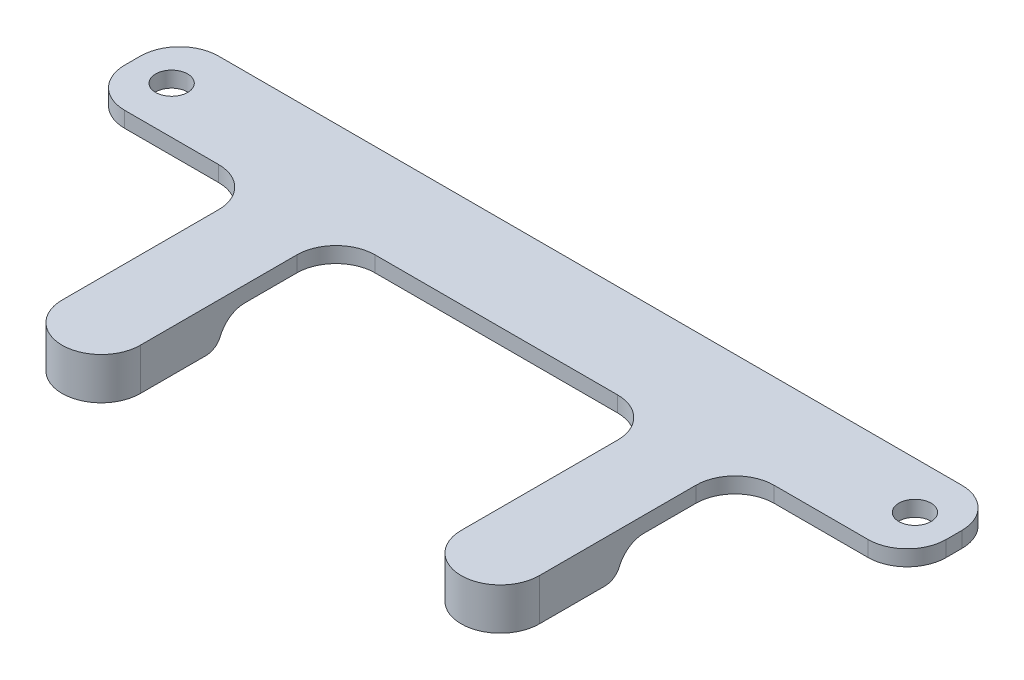
ISO-10303-21;
HEADER;
FILE_DESCRIPTION(('STEP AP214'),'2;1');
FILE_NAME('part.step','',(''),(''),'','','');
FILE_SCHEMA(('AUTOMOTIVE_DESIGN { 1 0 10303 214 1 1 1 1 }'));
ENDSEC;
DATA;
#1=APPLICATION_CONTEXT('core data for automotive mechanical design processes');
#2=APPLICATION_PROTOCOL_DEFINITION('international standard','automotive_design',2000,#1);
#3=PRODUCT_CONTEXT('',#1,'mechanical');
#4=PRODUCT('Part','Part','',(#3));
#5=PRODUCT_RELATED_PRODUCT_CATEGORY('part','',(#4));
#6=PRODUCT_DEFINITION_FORMATION('','',#4);
#7=PRODUCT_DEFINITION_CONTEXT('part definition',#1,'design');
#8=PRODUCT_DEFINITION('design','',#6,#7);
#9=PRODUCT_DEFINITION_SHAPE('','',#8);
#10=(LENGTH_UNIT() NAMED_UNIT(*) SI_UNIT(.MILLI.,.METRE.));
#11=(NAMED_UNIT(*) PLANE_ANGLE_UNIT() SI_UNIT($,.RADIAN.));
#12=(NAMED_UNIT(*) SI_UNIT($,.STERADIAN.) SOLID_ANGLE_UNIT());
#13=UNCERTAINTY_MEASURE_WITH_UNIT(LENGTH_MEASURE(1.E-05),#10,'distance_accuracy_value','');
#14=(GEOMETRIC_REPRESENTATION_CONTEXT(3) GLOBAL_UNCERTAINTY_ASSIGNED_CONTEXT((#13)) GLOBAL_UNIT_ASSIGNED_CONTEXT((#10,
#11,#12)) REPRESENTATION_CONTEXT('',''));
#15=CARTESIAN_POINT('',(0.,0.,0.));
#16=DIRECTION('',(0.,0.,1.));
#17=DIRECTION('',(1.,0.,0.));
#18=AXIS2_PLACEMENT_3D('',#15,#16,#17);
#19=CARTESIAN_POINT('',(0.,0.,0.));
#20=DIRECTION('',(0.,1.,0.));
#21=DIRECTION('',(0.,0.,1.));
#22=AXIS2_PLACEMENT_3D('',#19,#20,#21);
#23=PLANE('',#22);
#24=CARTESIAN_POINT('',(47.5,0.,0.));
#25=DIRECTION('',(0.,1.,0.));
#26=DIRECTION('',(0.,0.,-1.));
#27=AXIS2_PLACEMENT_3D('',#24,#25,#26);
#28=CIRCLE('',#27,2.05);
#29=CARTESIAN_POINT('',(47.5,0.,-2.05));
#30=VERTEX_POINT('',#29);
#31=EDGE_CURVE('E259',#30,#30,#28,.T.);
#32=ORIENTED_EDGE('',*,*,#31,.T.);
#33=EDGE_LOOP('',(#32));
#34=FACE_BOUND('',#33,.T.);
#35=CARTESIAN_POINT('',(-47.5,0.,0.));
#36=DIRECTION('',(0.,1.,0.));
#37=DIRECTION('',(0.,0.,1.));
#38=AXIS2_PLACEMENT_3D('',#35,#36,#37);
#39=CIRCLE('',#38,2.05);
#40=CARTESIAN_POINT('',(-47.5,0.,2.05));
#41=VERTEX_POINT('',#40);
#42=EDGE_CURVE('E260',#41,#41,#39,.T.);
#43=ORIENTED_EDGE('',*,*,#42,.T.);
#44=EDGE_LOOP('',(#43));
#45=FACE_BOUND('',#44,.T.);
#46=DIRECTION('',(0.,0.,-1.));
#47=VECTOR('',#46,1.);
#48=CARTESIAN_POINT('',(30.5,0.,6.));
#49=LINE('',#48,#47);
#50=CARTESIAN_POINT('',(30.5,0.,17.6400148809853));
#51=VERTEX_POINT('',#50);
#52=CARTESIAN_POINT('',(30.5,0.,11.));
#53=VERTEX_POINT('',#52);
#54=EDGE_CURVE('E335',#51,#53,#49,.T.);
#55=ORIENTED_EDGE('',*,*,#54,.F.);
#56=DIRECTION('',(-1.,0.,0.));
#57=VECTOR('',#56,1.);
#58=CARTESIAN_POINT('',(0.,0.,17.6400148809853));
#59=LINE('',#58,#57);
#60=CARTESIAN_POINT('',(20.5,0.,17.6400148809853));
#61=VERTEX_POINT('',#60);
#62=EDGE_CURVE('E492',#51,#61,#59,.T.);
#63=ORIENTED_EDGE('',*,*,#62,.T.);
#64=DIRECTION('',(0.,0.,1.));
#65=VECTOR('',#64,1.);
#66=CARTESIAN_POINT('',(20.5,0.,6.));
#67=LINE('',#66,#65);
#68=CARTESIAN_POINT('',(20.5,0.,11.));
#69=VERTEX_POINT('',#68);
#70=EDGE_CURVE('E331',#69,#61,#67,.T.);
#71=ORIENTED_EDGE('',*,*,#70,.F.);
#72=CARTESIAN_POINT('',(15.5,0.,11.));
#73=DIRECTION('',(0.,1.,0.));
#74=DIRECTION('',(0.,0.,1.));
#75=AXIS2_PLACEMENT_3D('',#72,#73,#74);
#76=CIRCLE('',#75,5.);
#77=CARTESIAN_POINT('',(15.5,0.,6.));
#78=VERTEX_POINT('',#77);
#79=EDGE_CURVE('E442',#69,#78,#76,.T.);
#80=ORIENTED_EDGE('',*,*,#79,.T.);
#81=DIRECTION('',(1.,0.,0.));
#82=VECTOR('',#81,1.);
#83=CARTESIAN_POINT('',(-20.5,0.,6.));
#84=LINE('',#83,#82);
#85=CARTESIAN_POINT('',(-15.5,0.,6.));
#86=VERTEX_POINT('',#85);
#87=EDGE_CURVE('E327',#86,#78,#84,.T.);
#88=ORIENTED_EDGE('',*,*,#87,.F.);
#89=CARTESIAN_POINT('',(-15.5,0.,11.));
#90=DIRECTION('',(0.,1.,0.));
#91=DIRECTION('',(0.,0.,1.));
#92=AXIS2_PLACEMENT_3D('',#89,#90,#91);
#93=CIRCLE('',#92,5.);
#94=CARTESIAN_POINT('',(-20.5,0.,11.));
#95=VERTEX_POINT('',#94);
#96=EDGE_CURVE('E455',#86,#95,#93,.T.);
#97=ORIENTED_EDGE('',*,*,#96,.T.);
#98=DIRECTION('',(0.,0.,-1.));
#99=VECTOR('',#98,1.);
#100=CARTESIAN_POINT('',(-20.5,0.,6.));
#101=LINE('',#100,#99);
#102=CARTESIAN_POINT('',(-20.5,0.,17.6400148809853));
#103=VERTEX_POINT('',#102);
#104=EDGE_CURVE('E324',#103,#95,#101,.T.);
#105=ORIENTED_EDGE('',*,*,#104,.F.);
#106=DIRECTION('',(1.,0.,0.));
#107=VECTOR('',#106,1.);
#108=CARTESIAN_POINT('',(0.,0.,17.6400148809853));
#109=LINE('',#108,#107);
#110=CARTESIAN_POINT('',(-30.5,0.,17.6400148809853));
#111=VERTEX_POINT('',#110);
#112=EDGE_CURVE('E468',#103,#111,#109,.F.);
#113=ORIENTED_EDGE('',*,*,#112,.T.);
#114=DIRECTION('',(0.,0.,1.));
#115=VECTOR('',#114,1.);
#116=CARTESIAN_POINT('',(-30.5,0.,6.));
#117=LINE('',#116,#115);
#118=CARTESIAN_POINT('',(-30.5,0.,11.));
#119=VERTEX_POINT('',#118);
#120=EDGE_CURVE('E320',#119,#111,#117,.T.);
#121=ORIENTED_EDGE('',*,*,#120,.F.);
#122=CARTESIAN_POINT('',(-35.5,0.,11.));
#123=DIRECTION('',(0.,1.,0.));
#124=DIRECTION('',(0.,0.,1.));
#125=AXIS2_PLACEMENT_3D('',#122,#123,#124);
#126=CIRCLE('',#125,5.);
#127=CARTESIAN_POINT('',(-35.5,0.,6.));
#128=VERTEX_POINT('',#127);
#129=EDGE_CURVE('E462',#119,#128,#126,.T.);
#130=ORIENTED_EDGE('',*,*,#129,.T.);
#131=DIRECTION('',(1.,0.,0.));
#132=VECTOR('',#131,1.);
#133=CARTESIAN_POINT('',(-52.5,0.,6.));
#134=LINE('',#133,#132);
#135=CARTESIAN_POINT('',(-47.5,0.,6.));
#136=VERTEX_POINT('',#135);
#137=EDGE_CURVE('E316',#136,#128,#134,.T.);
#138=ORIENTED_EDGE('',*,*,#137,.F.);
#139=CARTESIAN_POINT('',(-47.5,0.,1.));
#140=DIRECTION('',(0.,1.,0.));
#141=DIRECTION('',(0.,0.,1.));
#142=AXIS2_PLACEMENT_3D('',#139,#140,#141);
#143=CIRCLE('',#142,5.);
#144=CARTESIAN_POINT('',(-52.5,0.,1.));
#145=VERTEX_POINT('',#144);
#146=EDGE_CURVE('E355',#136,#145,#143,.F.);
#147=ORIENTED_EDGE('',*,*,#146,.T.);
#148=DIRECTION('',(0.,0.,1.));
#149=VECTOR('',#148,1.);
#150=CARTESIAN_POINT('',(-52.5,0.,-6.));
#151=LINE('',#150,#149);
#152=CARTESIAN_POINT('',(-52.5,0.,-1.));
#153=VERTEX_POINT('',#152);
#154=EDGE_CURVE('E264',#153,#145,#151,.T.);
#155=ORIENTED_EDGE('',*,*,#154,.F.);
#156=CARTESIAN_POINT('',(-47.5,0.,-1.));
#157=DIRECTION('',(0.,1.,0.));
#158=DIRECTION('',(0.,0.,1.));
#159=AXIS2_PLACEMENT_3D('',#156,#157,#158);
#160=CIRCLE('',#159,5.);
#161=CARTESIAN_POINT('',(-47.5,0.,-6.));
#162=VERTEX_POINT('',#161);
#163=EDGE_CURVE('E358',#153,#162,#160,.F.);
#164=ORIENTED_EDGE('',*,*,#163,.T.);
#165=DIRECTION('',(-1.,0.,0.));
#166=VECTOR('',#165,1.);
#167=CARTESIAN_POINT('',(-52.5,0.,-6.));
#168=LINE('',#167,#166);
#169=CARTESIAN_POINT('',(47.5,0.,-6.));
#170=VERTEX_POINT('',#169);
#171=EDGE_CURVE('E281',#170,#162,#168,.T.);
#172=ORIENTED_EDGE('',*,*,#171,.F.);
#173=CARTESIAN_POINT('',(47.5,0.,-1.));
#174=DIRECTION('',(0.,1.,0.));
#175=DIRECTION('',(0.,0.,1.));
#176=AXIS2_PLACEMENT_3D('',#173,#174,#175);
#177=CIRCLE('',#176,5.);
#178=CARTESIAN_POINT('',(52.5,0.,-1.));
#179=VERTEX_POINT('',#178);
#180=EDGE_CURVE('E364',#170,#179,#177,.F.);
#181=ORIENTED_EDGE('',*,*,#180,.T.);
#182=DIRECTION('',(0.,0.,-1.));
#183=VECTOR('',#182,1.);
#184=CARTESIAN_POINT('',(52.5,0.,-6.));
#185=LINE('',#184,#183);
#186=CARTESIAN_POINT('',(52.5,0.,1.));
#187=VERTEX_POINT('',#186);
#188=EDGE_CURVE('E342',#187,#179,#185,.T.);
#189=ORIENTED_EDGE('',*,*,#188,.F.);
#190=CARTESIAN_POINT('',(47.5,0.,1.));
#191=DIRECTION('',(0.,1.,0.));
#192=DIRECTION('',(0.,0.,1.));
#193=AXIS2_PLACEMENT_3D('',#190,#191,#192);
#194=CIRCLE('',#193,5.);
#195=CARTESIAN_POINT('',(47.5,0.,6.));
#196=VERTEX_POINT('',#195);
#197=EDGE_CURVE('E361',#187,#196,#194,.F.);
#198=ORIENTED_EDGE('',*,*,#197,.T.);
#199=DIRECTION('',(1.,0.,0.));
#200=VECTOR('',#199,1.);
#201=CARTESIAN_POINT('',(30.5,0.,6.));
#202=LINE('',#201,#200);
#203=CARTESIAN_POINT('',(35.5,0.,6.));
#204=VERTEX_POINT('',#203);
#205=EDGE_CURVE('E338',#204,#196,#202,.T.);
#206=ORIENTED_EDGE('',*,*,#205,.F.);
#207=CARTESIAN_POINT('',(35.5,0.,11.));
#208=DIRECTION('',(0.,1.,0.));
#209=DIRECTION('',(0.,0.,1.));
#210=AXIS2_PLACEMENT_3D('',#207,#208,#209);
#211=CIRCLE('',#210,5.);
#212=EDGE_CURVE('E448',#204,#53,#211,.T.);
#213=ORIENTED_EDGE('',*,*,#212,.T.);
#214=EDGE_LOOP('',(#55,#63,#71,#80,#88,#97,#105,#113,#121,#130,#138,#147,#155,#164,#172,#181,
#189,#198,#206,#213));
#215=FACE_BOUND('',#214,.T.);
#216=ADVANCED_FACE('F43',(#34,#45,#215),#23,.F.);
#217=CARTESIAN_POINT('',(-52.5,2.,-6.));
#218=DIRECTION('',(1.,0.,0.));
#219=DIRECTION('',(0.,0.,-1.));
#220=AXIS2_PLACEMENT_3D('',#217,#218,#219);
#221=PLANE('',#220);
#222=DIRECTION('',(0.,0.,1.));
#223=VECTOR('',#222,1.);
#224=CARTESIAN_POINT('',(-52.5,2.,-6.));
#225=LINE('',#224,#223);
#226=CARTESIAN_POINT('',(-52.5,2.,-1.));
#227=VERTEX_POINT('',#226);
#228=CARTESIAN_POINT('',(-52.5,2.,1.));
#229=VERTEX_POINT('',#228);
#230=EDGE_CURVE('E276',#227,#229,#225,.T.);
#231=ORIENTED_EDGE('',*,*,#230,.F.);
#232=DIRECTION('',(0.,-1.,0.));
#233=VECTOR('',#232,1.);
#234=CARTESIAN_POINT('',(-52.5,2.,-1.));
#235=LINE('',#234,#233);
#236=EDGE_CURVE('E438',#227,#153,#235,.T.);
#237=ORIENTED_EDGE('',*,*,#236,.T.);
#238=ORIENTED_EDGE('',*,*,#154,.T.);
#239=DIRECTION('',(0.,-1.,0.));
#240=VECTOR('',#239,1.);
#241=CARTESIAN_POINT('',(-52.5,2.,1.));
#242=LINE('',#241,#240);
#243=EDGE_CURVE('E435',#145,#229,#242,.F.);
#244=ORIENTED_EDGE('',*,*,#243,.T.);
#245=EDGE_LOOP('',(#231,#237,#238,#244));
#246=FACE_BOUND('',#245,.T.);
#247=ADVANCED_FACE('F517',(#246),#221,.F.);
#248=CARTESIAN_POINT('',(-52.5,2.,6.));
#249=DIRECTION('',(0.,0.,-1.));
#250=DIRECTION('',(-1.,0.,0.));
#251=AXIS2_PLACEMENT_3D('',#248,#249,#250);
#252=PLANE('',#251);
#253=ORIENTED_EDGE('',*,*,#137,.T.);
#254=DIRECTION('',(0.,-1.,0.));
#255=VECTOR('',#254,1.);
#256=CARTESIAN_POINT('',(-35.5,2.,6.));
#257=LINE('',#256,#255);
#258=CARTESIAN_POINT('',(-35.5,2.,6.));
#259=VERTEX_POINT('',#258);
#260=EDGE_CURVE('E432',#128,#259,#257,.F.);
#261=ORIENTED_EDGE('',*,*,#260,.T.);
#262=DIRECTION('',(1.,0.,0.));
#263=VECTOR('',#262,1.);
#264=CARTESIAN_POINT('',(-52.5,2.,6.));
#265=LINE('',#264,#263);
#266=CARTESIAN_POINT('',(-47.5,2.,6.));
#267=VERTEX_POINT('',#266);
#268=EDGE_CURVE('E280',#267,#259,#265,.T.);
#269=ORIENTED_EDGE('',*,*,#268,.F.);
#270=DIRECTION('',(0.,-1.,0.));
#271=VECTOR('',#270,1.);
#272=CARTESIAN_POINT('',(-47.5,2.,6.));
#273=LINE('',#272,#271);
#274=EDGE_CURVE('E428',#267,#136,#273,.T.);
#275=ORIENTED_EDGE('',*,*,#274,.T.);
#276=EDGE_LOOP('',(#253,#261,#269,#275));
#277=FACE_BOUND('',#276,.T.);
#278=ADVANCED_FACE('F523',(#277),#252,.F.);
#279=CARTESIAN_POINT('',(-30.5,2.,6.));
#280=DIRECTION('',(1.,0.,0.));
#281=DIRECTION('',(0.,0.,-1.));
#282=AXIS2_PLACEMENT_3D('',#279,#280,#281);
#283=PLANE('',#282);
#284=CARTESIAN_POINT('',(-30.5,-3.36,17.6400148809853));
#285=DIRECTION('',(1.,0.,0.));
#286=DIRECTION('',(0.,0.,-1.));
#287=AXIS2_PLACEMENT_3D('',#284,#285,#286);
#288=CIRCLE('',#287,3.36);
#289=CARTESIAN_POINT('',(-30.5,-2.1,20.7548182455655));
#290=VERTEX_POINT('',#289);
#291=EDGE_CURVE('E472',#111,#290,#288,.T.);
#292=ORIENTED_EDGE('',*,*,#291,.T.);
#293=CARTESIAN_POINT('',(-30.5,-1.35,22.6088678673394));
#294=DIRECTION('',(1.,0.,0.));
#295=DIRECTION('',(0.,0.,-1.));
#296=AXIS2_PLACEMENT_3D('',#293,#294,#295);
#297=CIRCLE('',#296,2.);
#298=CARTESIAN_POINT('',(-30.5,-3.35,22.6088678673394));
#299=VERTEX_POINT('',#298);
#300=EDGE_CURVE('E483',#290,#299,#297,.F.);
#301=ORIENTED_EDGE('',*,*,#300,.T.);
#302=DIRECTION('',(0.,0.,1.));
#303=VECTOR('',#302,1.);
#304=CARTESIAN_POINT('',(-30.5,-3.35,21.));
#305=LINE('',#304,#303);
#306=CARTESIAN_POINT('',(-30.5,-3.35,31.));
#307=VERTEX_POINT('',#306);
#308=EDGE_CURVE('E256',#299,#307,#305,.T.);
#309=ORIENTED_EDGE('',*,*,#308,.T.);
#310=DIRECTION('',(0.,-1.,0.));
#311=VECTOR('',#310,1.);
#312=CARTESIAN_POINT('',(-30.5,2.,31.));
#313=LINE('',#312,#311);
#314=CARTESIAN_POINT('',(-30.5,2.,31.));
#315=VERTEX_POINT('',#314);
#316=EDGE_CURVE('E417',#307,#315,#313,.F.);
#317=ORIENTED_EDGE('',*,*,#316,.T.);
#318=DIRECTION('',(0.,0.,1.));
#319=VECTOR('',#318,1.);
#320=CARTESIAN_POINT('',(-30.5,2.,6.));
#321=LINE('',#320,#319);
#322=CARTESIAN_POINT('',(-30.5,2.,11.));
#323=VERTEX_POINT('',#322);
#324=EDGE_CURVE('E285',#323,#315,#321,.T.);
#325=ORIENTED_EDGE('',*,*,#324,.F.);
#326=DIRECTION('',(0.,-1.,0.));
#327=VECTOR('',#326,1.);
#328=CARTESIAN_POINT('',(-30.5,0.,11.));
#329=LINE('',#328,#327);
#330=EDGE_CURVE('E413',#323,#119,#329,.T.);
#331=ORIENTED_EDGE('',*,*,#330,.T.);
#332=ORIENTED_EDGE('',*,*,#120,.T.);
#333=EDGE_LOOP('',(#292,#301,#309,#317,#325,#331,#332));
#334=FACE_BOUND('',#333,.T.);
#335=ADVANCED_FACE('F554',(#334),#283,.F.);
#336=CARTESIAN_POINT('',(-20.5,2.,6.));
#337=DIRECTION('',(-1.,0.,0.));
#338=DIRECTION('',(0.,0.,1.));
#339=AXIS2_PLACEMENT_3D('',#336,#337,#338);
#340=PLANE('',#339);
#341=DIRECTION('',(0.,0.,-1.));
#342=VECTOR('',#341,1.);
#343=CARTESIAN_POINT('',(-20.5,-3.35,31.));
#344=LINE('',#343,#342);
#345=CARTESIAN_POINT('',(-20.5,-3.35,31.));
#346=VERTEX_POINT('',#345);
#347=CARTESIAN_POINT('',(-20.5,-3.35,22.6088678673394));
#348=VERTEX_POINT('',#347);
#349=EDGE_CURVE('E252',#346,#348,#344,.T.);
#350=ORIENTED_EDGE('',*,*,#349,.T.);
#351=CARTESIAN_POINT('',(-20.5,-1.35,22.6088678673394));
#352=DIRECTION('',(-1.,0.,0.));
#353=DIRECTION('',(0.,0.,1.));
#354=AXIS2_PLACEMENT_3D('',#351,#352,#353);
#355=CIRCLE('',#354,2.);
#356=CARTESIAN_POINT('',(-20.5,-2.1,20.7548182455655));
#357=VERTEX_POINT('',#356);
#358=EDGE_CURVE('E489',#348,#357,#355,.F.);
#359=ORIENTED_EDGE('',*,*,#358,.T.);
#360=CARTESIAN_POINT('',(-20.5,-3.36,17.6400148809853));
#361=DIRECTION('',(-1.,0.,0.));
#362=DIRECTION('',(0.,0.,1.));
#363=AXIS2_PLACEMENT_3D('',#360,#361,#362);
#364=CIRCLE('',#363,3.36);
#365=EDGE_CURVE('E476',#357,#103,#364,.T.);
#366=ORIENTED_EDGE('',*,*,#365,.T.);
#367=ORIENTED_EDGE('',*,*,#104,.T.);
#368=DIRECTION('',(0.,-1.,0.));
#369=VECTOR('',#368,1.);
#370=CARTESIAN_POINT('',(-20.5,2.,11.));
#371=LINE('',#370,#369);
#372=CARTESIAN_POINT('',(-20.5,2.,11.));
#373=VERTEX_POINT('',#372);
#374=EDGE_CURVE('E421',#95,#373,#371,.F.);
#375=ORIENTED_EDGE('',*,*,#374,.T.);
#376=DIRECTION('',(0.,0.,-1.));
#377=VECTOR('',#376,1.);
#378=CARTESIAN_POINT('',(-20.5,2.,6.));
#379=LINE('',#378,#377);
#380=CARTESIAN_POINT('',(-20.5,2.,31.));
#381=VERTEX_POINT('',#380);
#382=EDGE_CURVE('E288',#381,#373,#379,.T.);
#383=ORIENTED_EDGE('',*,*,#382,.F.);
#384=DIRECTION('',(0.,-1.,0.));
#385=VECTOR('',#384,1.);
#386=CARTESIAN_POINT('',(-20.5,2.,31.));
#387=LINE('',#386,#385);
#388=EDGE_CURVE('E425',#381,#346,#387,.T.);
#389=ORIENTED_EDGE('',*,*,#388,.T.);
#390=EDGE_LOOP('',(#350,#359,#366,#367,#375,#383,#389));
#391=FACE_BOUND('',#390,.T.);
#392=ADVANCED_FACE('F550',(#391),#340,.F.);
#393=CARTESIAN_POINT('',(-20.5,2.,6.));
#394=DIRECTION('',(0.,0.,-1.));
#395=DIRECTION('',(-1.,0.,0.));
#396=AXIS2_PLACEMENT_3D('',#393,#394,#395);
#397=PLANE('',#396);
#398=ORIENTED_EDGE('',*,*,#87,.T.);
#399=DIRECTION('',(0.,-1.,0.));
#400=VECTOR('',#399,1.);
#401=CARTESIAN_POINT('',(15.5,2.,6.));
#402=LINE('',#401,#400);
#403=CARTESIAN_POINT('',(15.5,2.,6.));
#404=VERTEX_POINT('',#403);
#405=EDGE_CURVE('E237',#78,#404,#402,.F.);
#406=ORIENTED_EDGE('',*,*,#405,.T.);
#407=DIRECTION('',(1.,0.,0.));
#408=VECTOR('',#407,1.);
#409=CARTESIAN_POINT('',(-20.5,2.,6.));
#410=LINE('',#409,#408);
#411=CARTESIAN_POINT('',(-15.5,2.,6.));
#412=VERTEX_POINT('',#411);
#413=EDGE_CURVE('E291',#412,#404,#410,.T.);
#414=ORIENTED_EDGE('',*,*,#413,.F.);
#415=DIRECTION('',(0.,-1.,0.));
#416=VECTOR('',#415,1.);
#417=CARTESIAN_POINT('',(-15.5,0.,6.));
#418=LINE('',#417,#416);
#419=EDGE_CURVE('E405',#412,#86,#418,.T.);
#420=ORIENTED_EDGE('',*,*,#419,.T.);
#421=EDGE_LOOP('',(#398,#406,#414,#420));
#422=FACE_BOUND('',#421,.T.);
#423=ADVANCED_FACE('F547',(#422),#397,.F.);
#424=CARTESIAN_POINT('',(20.5,2.,6.));
#425=DIRECTION('',(1.,0.,0.));
#426=DIRECTION('',(0.,0.,-1.));
#427=AXIS2_PLACEMENT_3D('',#424,#425,#426);
#428=PLANE('',#427);
#429=CARTESIAN_POINT('',(20.5,-3.36,17.6400148809853));
#430=DIRECTION('',(1.,0.,0.));
#431=DIRECTION('',(0.,0.,-1.));
#432=AXIS2_PLACEMENT_3D('',#429,#430,#431);
#433=CIRCLE('',#432,3.36);
#434=CARTESIAN_POINT('',(20.5,-2.1,20.7548182455655));
#435=VERTEX_POINT('',#434);
#436=EDGE_CURVE('E498',#61,#435,#433,.T.);
#437=ORIENTED_EDGE('',*,*,#436,.T.);
#438=CARTESIAN_POINT('',(20.5,-1.35,22.6088678673394));
#439=DIRECTION('',(1.,0.,0.));
#440=DIRECTION('',(0.,0.,-1.));
#441=AXIS2_PLACEMENT_3D('',#438,#439,#440);
#442=CIRCLE('',#441,2.);
#443=CARTESIAN_POINT('',(20.5,-3.35,22.6088678673394));
#444=VERTEX_POINT('',#443);
#445=EDGE_CURVE('E11',#435,#444,#442,.F.);
#446=ORIENTED_EDGE('',*,*,#445,.T.);
#447=DIRECTION('',(0.,0.,-1.));
#448=VECTOR('',#447,1.);
#449=CARTESIAN_POINT('',(20.5,-3.35,31.));
#450=LINE('',#449,#448);
#451=CARTESIAN_POINT('',(20.5,-3.35,31.));
#452=VERTEX_POINT('',#451);
#453=EDGE_CURVE('E225',#452,#444,#450,.T.);
#454=ORIENTED_EDGE('',*,*,#453,.F.);
#455=DIRECTION('',(0.,-1.,0.));
#456=VECTOR('',#455,1.);
#457=CARTESIAN_POINT('',(20.5,2.,31.));
#458=LINE('',#457,#456);
#459=CARTESIAN_POINT('',(20.5,2.,31.));
#460=VERTEX_POINT('',#459);
#461=EDGE_CURVE('E241',#452,#460,#458,.F.);
#462=ORIENTED_EDGE('',*,*,#461,.T.);
#463=DIRECTION('',(0.,0.,1.));
#464=VECTOR('',#463,1.);
#465=CARTESIAN_POINT('',(20.5,2.,6.));
#466=LINE('',#465,#464);
#467=CARTESIAN_POINT('',(20.5,2.,11.));
#468=VERTEX_POINT('',#467);
#469=EDGE_CURVE('E295',#468,#460,#466,.T.);
#470=ORIENTED_EDGE('',*,*,#469,.F.);
#471=DIRECTION('',(0.,-1.,0.));
#472=VECTOR('',#471,1.);
#473=CARTESIAN_POINT('',(20.5,0.,11.));
#474=LINE('',#473,#472);
#475=EDGE_CURVE('E401',#468,#69,#474,.T.);
#476=ORIENTED_EDGE('',*,*,#475,.T.);
#477=ORIENTED_EDGE('',*,*,#70,.T.);
#478=EDGE_LOOP('',(#437,#446,#454,#462,#470,#476,#477));
#479=FACE_BOUND('',#478,.T.);
#480=ADVANCED_FACE('F507',(#479),#428,.F.);
#481=CARTESIAN_POINT('',(30.5,2.,6.));
#482=DIRECTION('',(-1.,0.,0.));
#483=DIRECTION('',(0.,0.,1.));
#484=AXIS2_PLACEMENT_3D('',#481,#482,#483);
#485=PLANE('',#484);
#486=DIRECTION('',(0.,0.,1.));
#487=VECTOR('',#486,1.);
#488=CARTESIAN_POINT('',(30.5,-3.35,21.));
#489=LINE('',#488,#487);
#490=CARTESIAN_POINT('',(30.5,-3.35,22.6088678673394));
#491=VERTEX_POINT('',#490);
#492=CARTESIAN_POINT('',(30.5,-3.35,31.));
#493=VERTEX_POINT('',#492);
#494=EDGE_CURVE('E216',#491,#493,#489,.T.);
#495=ORIENTED_EDGE('',*,*,#494,.F.);
#496=CARTESIAN_POINT('',(30.5,-1.35,22.6088678673394));
#497=DIRECTION('',(-1.,0.,0.));
#498=DIRECTION('',(0.,0.,1.));
#499=AXIS2_PLACEMENT_3D('',#496,#497,#498);
#500=CIRCLE('',#499,2.);
#501=CARTESIAN_POINT('',(30.5,-2.1,20.7548182455655));
#502=VERTEX_POINT('',#501);
#503=EDGE_CURVE('E66',#491,#502,#500,.F.);
#504=ORIENTED_EDGE('',*,*,#503,.T.);
#505=CARTESIAN_POINT('',(30.5,-3.36,17.6400148809853));
#506=DIRECTION('',(-1.,0.,0.));
#507=DIRECTION('',(0.,0.,1.));
#508=AXIS2_PLACEMENT_3D('',#505,#506,#507);
#509=CIRCLE('',#508,3.36);
#510=EDGE_CURVE('E495',#502,#51,#509,.T.);
#511=ORIENTED_EDGE('',*,*,#510,.T.);
#512=ORIENTED_EDGE('',*,*,#54,.T.);
#513=DIRECTION('',(0.,-1.,0.));
#514=VECTOR('',#513,1.);
#515=CARTESIAN_POINT('',(30.5,2.,11.));
#516=LINE('',#515,#514);
#517=CARTESIAN_POINT('',(30.5,2.,11.));
#518=VERTEX_POINT('',#517);
#519=EDGE_CURVE('E236',#53,#518,#516,.F.);
#520=ORIENTED_EDGE('',*,*,#519,.T.);
#521=DIRECTION('',(0.,0.,-1.));
#522=VECTOR('',#521,1.);
#523=CARTESIAN_POINT('',(30.5,2.,6.));
#524=LINE('',#523,#522);
#525=CARTESIAN_POINT('',(30.5,2.,31.));
#526=VERTEX_POINT('',#525);
#527=EDGE_CURVE('E232',#526,#518,#524,.T.);
#528=ORIENTED_EDGE('',*,*,#527,.F.);
#529=DIRECTION('',(0.,-1.,0.));
#530=VECTOR('',#529,1.);
#531=CARTESIAN_POINT('',(30.5,2.,31.));
#532=LINE('',#531,#530);
#533=EDGE_CURVE('E229',#526,#493,#532,.T.);
#534=ORIENTED_EDGE('',*,*,#533,.T.);
#535=EDGE_LOOP('',(#495,#504,#511,#512,#520,#528,#534));
#536=FACE_BOUND('',#535,.T.);
#537=ADVANCED_FACE('F230',(#536),#485,.F.);
#538=CARTESIAN_POINT('',(30.5,2.,6.));
#539=DIRECTION('',(0.,0.,-1.));
#540=DIRECTION('',(-1.,0.,0.));
#541=AXIS2_PLACEMENT_3D('',#538,#539,#540);
#542=PLANE('',#541);
#543=ORIENTED_EDGE('',*,*,#205,.T.);
#544=DIRECTION('',(0.,-1.,0.));
#545=VECTOR('',#544,1.);
#546=CARTESIAN_POINT('',(47.5,2.,6.));
#547=LINE('',#546,#545);
#548=CARTESIAN_POINT('',(47.5,2.,6.));
#549=VERTEX_POINT('',#548);
#550=EDGE_CURVE('E396',#196,#549,#547,.F.);
#551=ORIENTED_EDGE('',*,*,#550,.T.);
#552=DIRECTION('',(1.,0.,0.));
#553=VECTOR('',#552,1.);
#554=CARTESIAN_POINT('',(30.5,2.,6.));
#555=LINE('',#554,#553);
#556=CARTESIAN_POINT('',(35.5,2.,6.));
#557=VERTEX_POINT('',#556);
#558=EDGE_CURVE('E300',#557,#549,#555,.T.);
#559=ORIENTED_EDGE('',*,*,#558,.F.);
#560=DIRECTION('',(0.,-1.,0.));
#561=VECTOR('',#560,1.);
#562=CARTESIAN_POINT('',(35.5,0.,6.));
#563=LINE('',#562,#561);
#564=EDGE_CURVE('E392',#557,#204,#563,.T.);
#565=ORIENTED_EDGE('',*,*,#564,.T.);
#566=EDGE_LOOP('',(#543,#551,#559,#565));
#567=FACE_BOUND('',#566,.T.);
#568=ADVANCED_FACE('F538',(#567),#542,.F.);
#569=CARTESIAN_POINT('',(52.5,2.,-6.));
#570=DIRECTION('',(-1.,0.,0.));
#571=DIRECTION('',(0.,0.,1.));
#572=AXIS2_PLACEMENT_3D('',#569,#570,#571);
#573=PLANE('',#572);
#574=ORIENTED_EDGE('',*,*,#188,.T.);
#575=DIRECTION('',(0.,-1.,0.));
#576=VECTOR('',#575,1.);
#577=CARTESIAN_POINT('',(52.5,2.,-1.));
#578=LINE('',#577,#576);
#579=CARTESIAN_POINT('',(52.5,2.,-1.));
#580=VERTEX_POINT('',#579);
#581=EDGE_CURVE('E371',#179,#580,#578,.F.);
#582=ORIENTED_EDGE('',*,*,#581,.T.);
#583=DIRECTION('',(0.,0.,-1.));
#584=VECTOR('',#583,1.);
#585=CARTESIAN_POINT('',(52.5,2.,-6.));
#586=LINE('',#585,#584);
#587=CARTESIAN_POINT('',(52.5,2.,1.));
#588=VERTEX_POINT('',#587);
#589=EDGE_CURVE('E304',#588,#580,#586,.T.);
#590=ORIENTED_EDGE('',*,*,#589,.F.);
#591=DIRECTION('',(0.,-1.,0.));
#592=VECTOR('',#591,1.);
#593=CARTESIAN_POINT('',(52.5,2.,1.));
#594=LINE('',#593,#592);
#595=EDGE_CURVE('E367',#588,#187,#594,.T.);
#596=ORIENTED_EDGE('',*,*,#595,.T.);
#597=EDGE_LOOP('',(#574,#582,#590,#596));
#598=FACE_BOUND('',#597,.T.);
#599=ADVANCED_FACE('F534',(#598),#573,.F.);
#600=CARTESIAN_POINT('',(-52.5,2.,-6.));
#601=DIRECTION('',(0.,0.,1.));
#602=DIRECTION('',(1.,0.,0.));
#603=AXIS2_PLACEMENT_3D('',#600,#601,#602);
#604=PLANE('',#603);
#605=DIRECTION('',(-1.,0.,0.));
#606=VECTOR('',#605,1.);
#607=CARTESIAN_POINT('',(-52.5,2.,-6.));
#608=LINE('',#607,#606);
#609=CARTESIAN_POINT('',(47.5,2.,-6.));
#610=VERTEX_POINT('',#609);
#611=CARTESIAN_POINT('',(-47.5,2.,-6.));
#612=VERTEX_POINT('',#611);
#613=EDGE_CURVE('E308',#610,#612,#608,.T.);
#614=ORIENTED_EDGE('',*,*,#613,.F.);
#615=DIRECTION('',(0.,-1.,0.));
#616=VECTOR('',#615,1.);
#617=CARTESIAN_POINT('',(47.5,2.,-6.));
#618=LINE('',#617,#616);
#619=EDGE_CURVE('E351',#610,#170,#618,.T.);
#620=ORIENTED_EDGE('',*,*,#619,.T.);
#621=ORIENTED_EDGE('',*,*,#171,.T.);
#622=DIRECTION('',(0.,-1.,0.));
#623=VECTOR('',#622,1.);
#624=CARTESIAN_POINT('',(-47.5,2.,-6.));
#625=LINE('',#624,#623);
#626=EDGE_CURVE('E312',#162,#612,#625,.F.);
#627=ORIENTED_EDGE('',*,*,#626,.T.);
#628=EDGE_LOOP('',(#614,#620,#621,#627));
#629=FACE_BOUND('',#628,.T.);
#630=ADVANCED_FACE('F531',(#629),#604,.F.);
#631=CARTESIAN_POINT('',(0.,2.,0.));
#632=DIRECTION('',(0.,1.,0.));
#633=DIRECTION('',(0.,0.,1.));
#634=AXIS2_PLACEMENT_3D('',#631,#632,#633);
#635=PLANE('',#634);
#636=ORIENTED_EDGE('',*,*,#527,.T.);
#637=CARTESIAN_POINT('',(35.5,2.,11.));
#638=DIRECTION('',(0.,1.,0.));
#639=DIRECTION('',(0.,0.,1.));
#640=AXIS2_PLACEMENT_3D('',#637,#638,#639);
#641=CIRCLE('',#640,5.);
#642=EDGE_CURVE('E452',#518,#557,#641,.F.);
#643=ORIENTED_EDGE('',*,*,#642,.T.);
#644=ORIENTED_EDGE('',*,*,#558,.T.);
#645=CARTESIAN_POINT('',(47.5,2.,1.));
#646=DIRECTION('',(0.,1.,0.));
#647=DIRECTION('',(0.,0.,1.));
#648=AXIS2_PLACEMENT_3D('',#645,#646,#647);
#649=CIRCLE('',#648,5.);
#650=EDGE_CURVE('E386',#549,#588,#649,.T.);
#651=ORIENTED_EDGE('',*,*,#650,.T.);
#652=ORIENTED_EDGE('',*,*,#589,.T.);
#653=CARTESIAN_POINT('',(47.5,2.,-1.));
#654=DIRECTION('',(0.,1.,0.));
#655=DIRECTION('',(0.,0.,1.));
#656=AXIS2_PLACEMENT_3D('',#653,#654,#655);
#657=CIRCLE('',#656,5.);
#658=EDGE_CURVE('E389',#580,#610,#657,.T.);
#659=ORIENTED_EDGE('',*,*,#658,.T.);
#660=ORIENTED_EDGE('',*,*,#613,.T.);
#661=CARTESIAN_POINT('',(-47.5,2.,-1.));
#662=DIRECTION('',(0.,1.,0.));
#663=DIRECTION('',(0.,0.,1.));
#664=AXIS2_PLACEMENT_3D('',#661,#662,#663);
#665=CIRCLE('',#664,5.);
#666=EDGE_CURVE('E377',#612,#227,#665,.T.);
#667=ORIENTED_EDGE('',*,*,#666,.T.);
#668=ORIENTED_EDGE('',*,*,#230,.T.);
#669=CARTESIAN_POINT('',(-47.5,2.,1.));
#670=DIRECTION('',(0.,1.,0.));
#671=DIRECTION('',(0.,0.,1.));
#672=AXIS2_PLACEMENT_3D('',#669,#670,#671);
#673=CIRCLE('',#672,5.);
#674=EDGE_CURVE('E374',#229,#267,#673,.T.);
#675=ORIENTED_EDGE('',*,*,#674,.T.);
#676=ORIENTED_EDGE('',*,*,#268,.T.);
#677=CARTESIAN_POINT('',(-35.5,2.,11.));
#678=DIRECTION('',(0.,1.,0.));
#679=DIRECTION('',(0.,0.,1.));
#680=AXIS2_PLACEMENT_3D('',#677,#678,#679);
#681=CIRCLE('',#680,5.);
#682=EDGE_CURVE('E465',#259,#323,#681,.F.);
#683=ORIENTED_EDGE('',*,*,#682,.T.);
#684=ORIENTED_EDGE('',*,*,#324,.T.);
#685=CARTESIAN_POINT('',(-25.5,2.,31.));
#686=DIRECTION('',(0.,1.,0.));
#687=DIRECTION('',(0.,0.,1.));
#688=AXIS2_PLACEMENT_3D('',#685,#686,#687);
#689=CIRCLE('',#688,5.);
#690=EDGE_CURVE('E380',#315,#381,#689,.T.);
#691=ORIENTED_EDGE('',*,*,#690,.T.);
#692=ORIENTED_EDGE('',*,*,#382,.T.);
#693=CARTESIAN_POINT('',(-15.5,2.,11.));
#694=DIRECTION('',(0.,1.,0.));
#695=DIRECTION('',(0.,0.,1.));
#696=AXIS2_PLACEMENT_3D('',#693,#694,#695);
#697=CIRCLE('',#696,5.);
#698=EDGE_CURVE('E459',#373,#412,#697,.F.);
#699=ORIENTED_EDGE('',*,*,#698,.T.);
#700=ORIENTED_EDGE('',*,*,#413,.T.);
#701=CARTESIAN_POINT('',(15.5,2.,11.));
#702=DIRECTION('',(0.,1.,0.));
#703=DIRECTION('',(0.,0.,1.));
#704=AXIS2_PLACEMENT_3D('',#701,#702,#703);
#705=CIRCLE('',#704,5.);
#706=EDGE_CURVE('E445',#404,#468,#705,.F.);
#707=ORIENTED_EDGE('',*,*,#706,.T.);
#708=ORIENTED_EDGE('',*,*,#469,.T.);
#709=CARTESIAN_POINT('',(25.5,2.,31.));
#710=DIRECTION('',(0.,1.,0.));
#711=DIRECTION('',(0.,0.,1.));
#712=AXIS2_PLACEMENT_3D('',#709,#710,#711);
#713=CIRCLE('',#712,5.);
#714=EDGE_CURVE('E383',#460,#526,#713,.T.);
#715=ORIENTED_EDGE('',*,*,#714,.T.);
#716=EDGE_LOOP('',(#636,#643,#644,#651,#652,#659,#660,#667,#668,#675,#676,#683,#684,#691,#692,
#699,#700,#707,#708,#715));
#717=FACE_BOUND('',#716,.T.);
#718=CARTESIAN_POINT('',(-47.5,2.,0.));
#719=DIRECTION('',(0.,1.,0.));
#720=DIRECTION('',(0.,0.,1.));
#721=AXIS2_PLACEMENT_3D('',#718,#719,#720);
#722=CIRCLE('',#721,2.05);
#723=CARTESIAN_POINT('',(-47.5,2.,2.05));
#724=VERTEX_POINT('',#723);
#725=EDGE_CURVE('E265',#724,#724,#722,.T.);
#726=ORIENTED_EDGE('',*,*,#725,.F.);
#727=EDGE_LOOP('',(#726));
#728=FACE_BOUND('',#727,.T.);
#729=CARTESIAN_POINT('',(47.5,2.,0.));
#730=DIRECTION('',(0.,1.,0.));
#731=DIRECTION('',(0.,0.,-1.));
#732=AXIS2_PLACEMENT_3D('',#729,#730,#731);
#733=CIRCLE('',#732,2.05);
#734=CARTESIAN_POINT('',(47.5,2.,-2.05));
#735=VERTEX_POINT('',#734);
#736=EDGE_CURVE('E269',#735,#735,#733,.T.);
#737=ORIENTED_EDGE('',*,*,#736,.F.);
#738=EDGE_LOOP('',(#737));
#739=FACE_BOUND('',#738,.T.);
#740=ADVANCED_FACE('F529',(#717,#728,#739),#635,.T.);
#741=CARTESIAN_POINT('',(47.5,0.,0.));
#742=DIRECTION('',(0.,1.,0.));
#743=DIRECTION('',(0.,0.,1.));
#744=AXIS2_PLACEMENT_3D('',#741,#742,#743);
#745=CYLINDRICAL_SURFACE('',#744,2.05);
#746=ORIENTED_EDGE('',*,*,#31,.F.);
#747=EDGE_LOOP('',(#746));
#748=FACE_BOUND('',#747,.T.);
#749=ORIENTED_EDGE('',*,*,#736,.T.);
#750=EDGE_LOOP('',(#749));
#751=FACE_BOUND('',#750,.T.);
#752=ADVANCED_FACE('F674',(#748,#751),#745,.F.);
#753=CARTESIAN_POINT('',(-47.5,0.,0.));
#754=DIRECTION('',(0.,1.,0.));
#755=DIRECTION('',(0.,0.,1.));
#756=AXIS2_PLACEMENT_3D('',#753,#754,#755);
#757=CYLINDRICAL_SURFACE('',#756,2.05);
#758=ORIENTED_EDGE('',*,*,#42,.F.);
#759=EDGE_LOOP('',(#758));
#760=FACE_BOUND('',#759,.T.);
#761=ORIENTED_EDGE('',*,*,#725,.T.);
#762=EDGE_LOOP('',(#761));
#763=FACE_BOUND('',#762,.T.);
#764=ADVANCED_FACE('F566',(#760,#763),#757,.F.);
#765=CARTESIAN_POINT('',(47.5,2.,-1.));
#766=DIRECTION('',(0.,-1.,0.));
#767=DIRECTION('',(0.,0.,-1.));
#768=AXIS2_PLACEMENT_3D('',#765,#766,#767);
#769=CYLINDRICAL_SURFACE('',#768,5.);
#770=ORIENTED_EDGE('',*,*,#658,.F.);
#771=ORIENTED_EDGE('',*,*,#581,.F.);
#772=ORIENTED_EDGE('',*,*,#180,.F.);
#773=ORIENTED_EDGE('',*,*,#619,.F.);
#774=EDGE_LOOP('',(#770,#771,#772,#773));
#775=FACE_BOUND('',#774,.T.);
#776=ADVANCED_FACE('F562',(#775),#769,.T.);
#777=CARTESIAN_POINT('',(47.5,2.,1.));
#778=DIRECTION('',(0.,-1.,0.));
#779=DIRECTION('',(0.,0.,-1.));
#780=AXIS2_PLACEMENT_3D('',#777,#778,#779);
#781=CYLINDRICAL_SURFACE('',#780,5.);
#782=ORIENTED_EDGE('',*,*,#650,.F.);
#783=ORIENTED_EDGE('',*,*,#550,.F.);
#784=ORIENTED_EDGE('',*,*,#197,.F.);
#785=ORIENTED_EDGE('',*,*,#595,.F.);
#786=EDGE_LOOP('',(#782,#783,#784,#785));
#787=FACE_BOUND('',#786,.T.);
#788=ADVANCED_FACE('F565',(#787),#781,.T.);
#789=CARTESIAN_POINT('',(15.5,2.,11.));
#790=DIRECTION('',(0.,1.,0.));
#791=DIRECTION('',(0.,0.,1.));
#792=AXIS2_PLACEMENT_3D('',#789,#790,#791);
#793=CYLINDRICAL_SURFACE('',#792,5.);
#794=ORIENTED_EDGE('',*,*,#706,.F.);
#795=ORIENTED_EDGE('',*,*,#405,.F.);
#796=ORIENTED_EDGE('',*,*,#79,.F.);
#797=ORIENTED_EDGE('',*,*,#475,.F.);
#798=EDGE_LOOP('',(#794,#795,#796,#797));
#799=FACE_BOUND('',#798,.T.);
#800=ADVANCED_FACE('F570',(#799),#793,.F.);
#801=CARTESIAN_POINT('',(35.5,2.,11.));
#802=DIRECTION('',(0.,1.,0.));
#803=DIRECTION('',(0.,0.,1.));
#804=AXIS2_PLACEMENT_3D('',#801,#802,#803);
#805=CYLINDRICAL_SURFACE('',#804,5.);
#806=ORIENTED_EDGE('',*,*,#642,.F.);
#807=ORIENTED_EDGE('',*,*,#519,.F.);
#808=ORIENTED_EDGE('',*,*,#212,.F.);
#809=ORIENTED_EDGE('',*,*,#564,.F.);
#810=EDGE_LOOP('',(#806,#807,#808,#809));
#811=FACE_BOUND('',#810,.T.);
#812=ADVANCED_FACE('F574',(#811),#805,.F.);
#813=CARTESIAN_POINT('',(25.5,2.,31.));
#814=DIRECTION('',(0.,-1.,0.));
#815=DIRECTION('',(0.,0.,-1.));
#816=AXIS2_PLACEMENT_3D('',#813,#814,#815);
#817=CYLINDRICAL_SURFACE('',#816,5.);
#818=ORIENTED_EDGE('',*,*,#533,.F.);
#819=ORIENTED_EDGE('',*,*,#714,.F.);
#820=ORIENTED_EDGE('',*,*,#461,.F.);
#821=CARTESIAN_POINT('',(25.5,-3.35,31.));
#822=DIRECTION('',(0.,-1.,0.));
#823=DIRECTION('',(0.,0.,1.));
#824=AXIS2_PLACEMENT_3D('',#821,#822,#823);
#825=CIRCLE('',#824,5.);
#826=EDGE_CURVE('E221',#493,#452,#825,.T.);
#827=ORIENTED_EDGE('',*,*,#826,.F.);
#828=EDGE_LOOP('',(#818,#819,#820,#827));
#829=FACE_BOUND('',#828,.T.);
#830=ADVANCED_FACE('F239',(#829),#817,.T.);
#831=CARTESIAN_POINT('',(-25.5,2.,31.));
#832=DIRECTION('',(0.,-1.,0.));
#833=DIRECTION('',(0.,0.,-1.));
#834=AXIS2_PLACEMENT_3D('',#831,#832,#833);
#835=CYLINDRICAL_SURFACE('',#834,5.);
#836=ORIENTED_EDGE('',*,*,#690,.F.);
#837=ORIENTED_EDGE('',*,*,#316,.F.);
#838=CARTESIAN_POINT('',(-25.5,-3.35,31.));
#839=DIRECTION('',(0.,1.,0.));
#840=DIRECTION('',(0.,0.,1.));
#841=AXIS2_PLACEMENT_3D('',#838,#839,#840);
#842=CIRCLE('',#841,5.);
#843=EDGE_CURVE('E248',#307,#346,#842,.T.);
#844=ORIENTED_EDGE('',*,*,#843,.T.);
#845=ORIENTED_EDGE('',*,*,#388,.F.);
#846=EDGE_LOOP('',(#836,#837,#844,#845));
#847=FACE_BOUND('',#846,.T.);
#848=ADVANCED_FACE('F581',(#847),#835,.T.);
#849=CARTESIAN_POINT('',(-15.5,2.,11.));
#850=DIRECTION('',(0.,1.,0.));
#851=DIRECTION('',(0.,0.,1.));
#852=AXIS2_PLACEMENT_3D('',#849,#850,#851);
#853=CYLINDRICAL_SURFACE('',#852,5.);
#854=ORIENTED_EDGE('',*,*,#698,.F.);
#855=ORIENTED_EDGE('',*,*,#374,.F.);
#856=ORIENTED_EDGE('',*,*,#96,.F.);
#857=ORIENTED_EDGE('',*,*,#419,.F.);
#858=EDGE_LOOP('',(#854,#855,#856,#857));
#859=FACE_BOUND('',#858,.T.);
#860=ADVANCED_FACE('F584',(#859),#853,.F.);
#861=CARTESIAN_POINT('',(-35.5,2.,11.));
#862=DIRECTION('',(0.,1.,0.));
#863=DIRECTION('',(0.,0.,1.));
#864=AXIS2_PLACEMENT_3D('',#861,#862,#863);
#865=CYLINDRICAL_SURFACE('',#864,5.);
#866=ORIENTED_EDGE('',*,*,#682,.F.);
#867=ORIENTED_EDGE('',*,*,#260,.F.);
#868=ORIENTED_EDGE('',*,*,#129,.F.);
#869=ORIENTED_EDGE('',*,*,#330,.F.);
#870=EDGE_LOOP('',(#866,#867,#868,#869));
#871=FACE_BOUND('',#870,.T.);
#872=ADVANCED_FACE('F588',(#871),#865,.F.);
#873=CARTESIAN_POINT('',(-47.5,2.,-1.));
#874=DIRECTION('',(0.,-1.,0.));
#875=DIRECTION('',(0.,0.,-1.));
#876=AXIS2_PLACEMENT_3D('',#873,#874,#875);
#877=CYLINDRICAL_SURFACE('',#876,5.);
#878=ORIENTED_EDGE('',*,*,#666,.F.);
#879=ORIENTED_EDGE('',*,*,#626,.F.);
#880=ORIENTED_EDGE('',*,*,#163,.F.);
#881=ORIENTED_EDGE('',*,*,#236,.F.);
#882=EDGE_LOOP('',(#878,#879,#880,#881));
#883=FACE_BOUND('',#882,.T.);
#884=ADVANCED_FACE('F592',(#883),#877,.T.);
#885=CARTESIAN_POINT('',(-47.5,2.,1.));
#886=DIRECTION('',(0.,-1.,0.));
#887=DIRECTION('',(0.,0.,-1.));
#888=AXIS2_PLACEMENT_3D('',#885,#886,#887);
#889=CYLINDRICAL_SURFACE('',#888,5.);
#890=ORIENTED_EDGE('',*,*,#674,.F.);
#891=ORIENTED_EDGE('',*,*,#243,.F.);
#892=ORIENTED_EDGE('',*,*,#146,.F.);
#893=ORIENTED_EDGE('',*,*,#274,.F.);
#894=EDGE_LOOP('',(#890,#891,#892,#893));
#895=FACE_BOUND('',#894,.T.);
#896=ADVANCED_FACE('F596',(#895),#889,.T.);
#897=CARTESIAN_POINT('',(-25.5,-3.35,31.));
#898=DIRECTION('',(0.,1.,0.));
#899=DIRECTION('',(0.,0.,1.));
#900=AXIS2_PLACEMENT_3D('',#897,#898,#899);
#901=PLANE('',#900);
#902=ORIENTED_EDGE('',*,*,#308,.F.);
#903=DIRECTION('',(1.,0.,0.));
#904=VECTOR('',#903,1.);
#905=CARTESIAN_POINT('',(-25.5,-3.35,22.6088678673394));
#906=LINE('',#905,#904);
#907=EDGE_CURVE('E486',#299,#348,#906,.T.);
#908=ORIENTED_EDGE('',*,*,#907,.T.);
#909=ORIENTED_EDGE('',*,*,#349,.F.);
#910=ORIENTED_EDGE('',*,*,#843,.F.);
#911=EDGE_LOOP('',(#902,#908,#909,#910));
#912=FACE_BOUND('',#911,.T.);
#913=ADVANCED_FACE('F600',(#912),#901,.F.);
#914=CARTESIAN_POINT('',(-30.5,-3.36,17.6400148809853));
#915=DIRECTION('',(1.,0.,0.));
#916=DIRECTION('',(0.,0.,-1.));
#917=AXIS2_PLACEMENT_3D('',#914,#915,#916);
#918=CYLINDRICAL_SURFACE('',#917,3.36);
#919=ORIENTED_EDGE('',*,*,#365,.F.);
#920=DIRECTION('',(1.,0.,0.));
#921=VECTOR('',#920,1.);
#922=CARTESIAN_POINT('',(-30.5,-2.1,20.7548182455655));
#923=LINE('',#922,#921);
#924=EDGE_CURVE('E479',#357,#290,#923,.F.);
#925=ORIENTED_EDGE('',*,*,#924,.T.);
#926=ORIENTED_EDGE('',*,*,#291,.F.);
#927=ORIENTED_EDGE('',*,*,#112,.F.);
#928=EDGE_LOOP('',(#919,#925,#926,#927));
#929=FACE_BOUND('',#928,.T.);
#930=ADVANCED_FACE('F602',(#929),#918,.F.);
#931=CARTESIAN_POINT('',(-30.5,-1.35,22.6088678673394));
#932=DIRECTION('',(1.,0.,0.));
#933=DIRECTION('',(0.,0.,-1.));
#934=AXIS2_PLACEMENT_3D('',#931,#932,#933);
#935=CYLINDRICAL_SURFACE('',#934,2.);
#936=ORIENTED_EDGE('',*,*,#358,.F.);
#937=ORIENTED_EDGE('',*,*,#907,.F.);
#938=ORIENTED_EDGE('',*,*,#300,.F.);
#939=ORIENTED_EDGE('',*,*,#924,.F.);
#940=EDGE_LOOP('',(#936,#937,#938,#939));
#941=FACE_BOUND('',#940,.T.);
#942=ADVANCED_FACE('F605',(#941),#935,.T.);
#943=CARTESIAN_POINT('',(25.5,-3.35,31.));
#944=DIRECTION('',(0.,1.,0.));
#945=DIRECTION('',(0.,0.,1.));
#946=AXIS2_PLACEMENT_3D('',#943,#944,#945);
#947=PLANE('',#946);
#948=ORIENTED_EDGE('',*,*,#453,.T.);
#949=DIRECTION('',(-1.,0.,0.));
#950=VECTOR('',#949,1.);
#951=CARTESIAN_POINT('',(25.5,-3.35,22.6088678673394));
#952=LINE('',#951,#950);
#953=EDGE_CURVE('E223',#444,#491,#952,.F.);
#954=ORIENTED_EDGE('',*,*,#953,.T.);
#955=ORIENTED_EDGE('',*,*,#494,.T.);
#956=ORIENTED_EDGE('',*,*,#826,.T.);
#957=EDGE_LOOP('',(#948,#954,#955,#956));
#958=FACE_BOUND('',#957,.T.);
#959=ADVANCED_FACE('F219',(#958),#947,.F.);
#960=CARTESIAN_POINT('',(30.5,-3.36,17.6400148809853));
#961=DIRECTION('',(-1.,0.,0.));
#962=DIRECTION('',(0.,0.,1.));
#963=AXIS2_PLACEMENT_3D('',#960,#961,#962);
#964=CYLINDRICAL_SURFACE('',#963,3.36);
#965=ORIENTED_EDGE('',*,*,#510,.F.);
#966=DIRECTION('',(-1.,0.,0.));
#967=VECTOR('',#966,1.);
#968=CARTESIAN_POINT('',(30.5,-2.1,20.7548182455655));
#969=LINE('',#968,#967);
#970=EDGE_CURVE('E52',#502,#435,#969,.T.);
#971=ORIENTED_EDGE('',*,*,#970,.T.);
#972=ORIENTED_EDGE('',*,*,#436,.F.);
#973=ORIENTED_EDGE('',*,*,#62,.F.);
#974=EDGE_LOOP('',(#965,#971,#972,#973));
#975=FACE_BOUND('',#974,.T.);
#976=ADVANCED_FACE('F512',(#975),#964,.F.);
#977=CARTESIAN_POINT('',(30.5,-1.35,22.6088678673394));
#978=DIRECTION('',(-1.,0.,0.));
#979=DIRECTION('',(0.,0.,1.));
#980=AXIS2_PLACEMENT_3D('',#977,#978,#979);
#981=CYLINDRICAL_SURFACE('',#980,2.);
#982=ORIENTED_EDGE('',*,*,#445,.F.);
#983=ORIENTED_EDGE('',*,*,#970,.F.);
#984=ORIENTED_EDGE('',*,*,#503,.F.);
#985=ORIENTED_EDGE('',*,*,#953,.F.);
#986=EDGE_LOOP('',(#982,#983,#984,#985));
#987=FACE_BOUND('',#986,.T.);
#988=ADVANCED_FACE('F45',(#987),#981,.T.);
#989=CLOSED_SHELL('',(#216,#247,#278,#335,#392,#423,#480,#537,#568,#599,#630,#740,#752,#764,
#776,#788,#800,#812,#830,#848,#860,#872,#884,#896,#913,#930,#942,#959,#976,#988));
#990=MANIFOLD_SOLID_BREP('B2',#989);
#991=ADVANCED_BREP_SHAPE_REPRESENTATION('',(#18,#990),#14);
#992=SHAPE_DEFINITION_REPRESENTATION(#9,#991);
ENDSEC;
END-ISO-10303-21;
